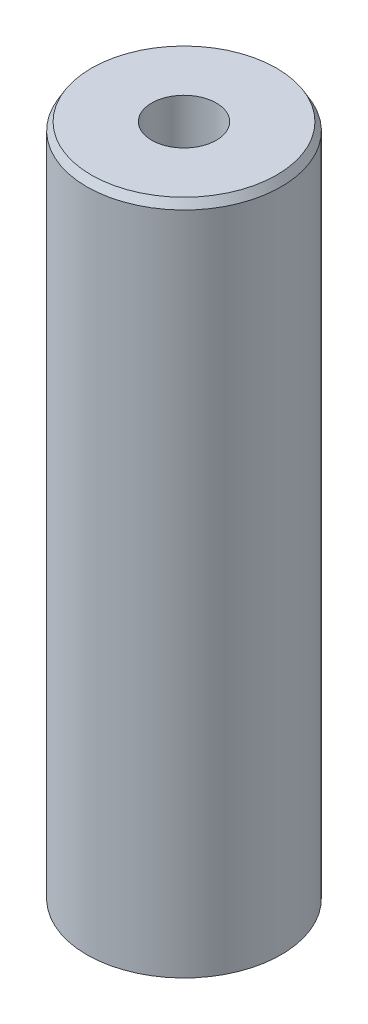
ISO-10303-21;
HEADER;
FILE_DESCRIPTION(('STEP AP214'),'2;1');
FILE_NAME('part.step','',(''),(''),'','','');
FILE_SCHEMA(('AUTOMOTIVE_DESIGN { 1 0 10303 214 1 1 1 1 }'));
ENDSEC;
DATA;
#1=APPLICATION_CONTEXT('core data for automotive mechanical design processes');
#2=APPLICATION_PROTOCOL_DEFINITION('international standard','automotive_design',2000,#1);
#3=PRODUCT_CONTEXT('',#1,'mechanical');
#4=PRODUCT('Part','Part','',(#3));
#5=PRODUCT_RELATED_PRODUCT_CATEGORY('part','',(#4));
#6=PRODUCT_DEFINITION_FORMATION('','',#4);
#7=PRODUCT_DEFINITION_CONTEXT('part definition',#1,'design');
#8=PRODUCT_DEFINITION('design','',#6,#7);
#9=PRODUCT_DEFINITION_SHAPE('','',#8);
#10=(LENGTH_UNIT() NAMED_UNIT(*) SI_UNIT(.MILLI.,.METRE.));
#11=(NAMED_UNIT(*) PLANE_ANGLE_UNIT() SI_UNIT($,.RADIAN.));
#12=(NAMED_UNIT(*) SI_UNIT($,.STERADIAN.) SOLID_ANGLE_UNIT());
#13=UNCERTAINTY_MEASURE_WITH_UNIT(LENGTH_MEASURE(1.E-05),#10,'distance_accuracy_value','');
#14=(GEOMETRIC_REPRESENTATION_CONTEXT(3) GLOBAL_UNCERTAINTY_ASSIGNED_CONTEXT((#13)) GLOBAL_UNIT_ASSIGNED_CONTEXT((#10,
#11,#12)) REPRESENTATION_CONTEXT('',''));
#15=CARTESIAN_POINT('',(0.,0.,0.));
#16=DIRECTION('',(0.,0.,1.));
#17=DIRECTION('',(1.,0.,0.));
#18=AXIS2_PLACEMENT_3D('',#15,#16,#17);
#19=CARTESIAN_POINT('',(0.,313.793971906121,0.));
#20=DIRECTION('',(0.,-1.,0.));
#21=DIRECTION('',(0.,0.,-1.));
#22=AXIS2_PLACEMENT_3D('',#19,#20,#21);
#23=CYLINDRICAL_SURFACE('',#22,45.);
#24=CARTESIAN_POINT('',(0.,310.14276828871,0.));
#25=DIRECTION('',(0.,1.,0.));
#26=DIRECTION('',(0.,0.,1.));
#27=AXIS2_PLACEMENT_3D('',#24,#25,#26);
#28=CIRCLE('',#27,45.);
#29=CARTESIAN_POINT('',(0.,310.14276828871,45.));
#30=VERTEX_POINT('',#29);
#31=EDGE_CURVE('E50',#30,#30,#28,.F.);
#32=ORIENTED_EDGE('',*,*,#31,.T.);
#33=EDGE_LOOP('',(#32));
#34=FACE_BOUND('',#33,.T.);
#35=CARTESIAN_POINT('',(0.,2.10802339137789,0.));
#36=DIRECTION('',(0.,1.,0.));
#37=DIRECTION('',(0.,0.,1.));
#38=AXIS2_PLACEMENT_3D('',#35,#36,#37);
#39=CIRCLE('',#38,45.);
#40=CARTESIAN_POINT('',(0.,2.10802339137789,45.));
#41=VERTEX_POINT('',#40);
#42=EDGE_CURVE('E51',#41,#41,#39,.T.);
#43=ORIENTED_EDGE('',*,*,#42,.T.);
#44=EDGE_LOOP('',(#43));
#45=FACE_BOUND('',#44,.T.);
#46=ADVANCED_FACE('F39',(#34,#45),#23,.T.);
#47=CARTESIAN_POINT('',(0.,313.793971906121,0.));
#48=DIRECTION('',(0.,1.,0.));
#49=DIRECTION('',(0.,0.,1.));
#50=AXIS2_PLACEMENT_3D('',#47,#48,#49);
#51=PLANE('',#50);
#52=CARTESIAN_POINT('',(0.,313.793971906121,0.));
#53=DIRECTION('',(0.,1.,0.));
#54=DIRECTION('',(0.,0.,1.));
#55=AXIS2_PLACEMENT_3D('',#52,#53,#54);
#56=CIRCLE('',#55,42.8919766086221);
#57=CARTESIAN_POINT('',(0.,313.793971906121,42.8919766086221));
#58=VERTEX_POINT('',#57);
#59=EDGE_CURVE('E54',#58,#58,#56,.T.);
#60=ORIENTED_EDGE('',*,*,#59,.T.);
#61=EDGE_LOOP('',(#60));
#62=FACE_BOUND('',#61,.T.);
#63=CARTESIAN_POINT('',(0.,313.793971906121,0.));
#64=DIRECTION('',(0.,1.,0.));
#65=DIRECTION('',(0.,0.,1.));
#66=AXIS2_PLACEMENT_3D('',#63,#64,#65);
#67=CIRCLE('',#66,14.9668758032071);
#68=CARTESIAN_POINT('',(0.,313.793971906121,14.9668758032071));
#69=VERTEX_POINT('',#68);
#70=EDGE_CURVE('E58',#69,#69,#67,.T.);
#71=ORIENTED_EDGE('',*,*,#70,.F.);
#72=EDGE_LOOP('',(#71));
#73=FACE_BOUND('',#72,.T.);
#74=ADVANCED_FACE('F69',(#62,#73),#51,.T.);
#75=CARTESIAN_POINT('',(0.,0.,0.));
#76=DIRECTION('',(0.,1.,0.));
#77=DIRECTION('',(0.,0.,1.));
#78=AXIS2_PLACEMENT_3D('',#75,#76,#77);
#79=PLANE('',#78);
#80=CARTESIAN_POINT('',(0.,0.,0.));
#81=DIRECTION('',(0.,1.,0.));
#82=DIRECTION('',(0.,0.,1.));
#83=AXIS2_PLACEMENT_3D('',#80,#81,#82);
#84=CIRCLE('',#83,41.3487963825898);
#85=CARTESIAN_POINT('',(0.,0.,41.3487963825898));
#86=VERTEX_POINT('',#85);
#87=EDGE_CURVE('E10',#86,#86,#84,.F.);
#88=ORIENTED_EDGE('',*,*,#87,.T.);
#89=EDGE_LOOP('',(#88));
#90=FACE_BOUND('',#89,.T.);
#91=CARTESIAN_POINT('',(0.,0.,0.));
#92=DIRECTION('',(0.,1.,0.));
#93=DIRECTION('',(0.,0.,1.));
#94=AXIS2_PLACEMENT_3D('',#91,#92,#93);
#95=CIRCLE('',#94,14.9668758032071);
#96=CARTESIAN_POINT('',(0.,0.,14.9668758032071));
#97=VERTEX_POINT('',#96);
#98=EDGE_CURVE('E63',#97,#97,#95,.T.);
#99=ORIENTED_EDGE('',*,*,#98,.T.);
#100=EDGE_LOOP('',(#99));
#101=FACE_BOUND('',#100,.T.);
#102=ADVANCED_FACE('F75',(#90,#101),#79,.F.);
#103=CARTESIAN_POINT('',(0.,313.793971906121,0.));
#104=DIRECTION('',(0.,-1.,0.));
#105=DIRECTION('',(0.,0.,-1.));
#106=AXIS2_PLACEMENT_3D('',#103,#104,#105);
#107=CYLINDRICAL_SURFACE('',#106,14.9668758032071);
#108=ORIENTED_EDGE('',*,*,#70,.T.);
#109=EDGE_LOOP('',(#108));
#110=FACE_BOUND('',#109,.T.);
#111=ORIENTED_EDGE('',*,*,#98,.F.);
#112=EDGE_LOOP('',(#111));
#113=FACE_BOUND('',#112,.T.);
#114=ADVANCED_FACE('F70',(#110,#113),#107,.F.);
#115=CARTESIAN_POINT('',(0.,313.793971906121,0.));
#116=DIRECTION('',(0.,-1.,0.));
#117=DIRECTION('',(0.,0.,-1.));
#118=AXIS2_PLACEMENT_3D('',#115,#116,#117);
#119=CONICAL_SURFACE('',#118,42.8919766086221,0.523598775598296);
#120=ORIENTED_EDGE('',*,*,#31,.F.);
#121=EDGE_LOOP('',(#120));
#122=FACE_BOUND('',#121,.T.);
#123=ORIENTED_EDGE('',*,*,#59,.F.);
#124=EDGE_LOOP('',(#123));
#125=FACE_BOUND('',#124,.T.);
#126=ADVANCED_FACE('F81',(#122,#125),#119,.T.);
#127=CARTESIAN_POINT('',(0.,2.10802339137789,0.));
#128=DIRECTION('',(0.,1.,0.));
#129=DIRECTION('',(0.,0.,1.));
#130=AXIS2_PLACEMENT_3D('',#127,#128,#129);
#131=CONICAL_SURFACE('',#130,45.,1.0471975511966);
#132=ORIENTED_EDGE('',*,*,#87,.F.);
#133=EDGE_LOOP('',(#132));
#134=FACE_BOUND('',#133,.T.);
#135=ORIENTED_EDGE('',*,*,#42,.F.);
#136=EDGE_LOOP('',(#135));
#137=FACE_BOUND('',#136,.T.);
#138=ADVANCED_FACE('F45',(#134,#137),#131,.T.);
#139=CLOSED_SHELL('',(#46,#74,#102,#114,#126,#138));
#140=MANIFOLD_SOLID_BREP('B2',#139);
#141=ADVANCED_BREP_SHAPE_REPRESENTATION('',(#18,#140),#14);
#142=SHAPE_DEFINITION_REPRESENTATION(#9,#141);
ENDSEC;
END-ISO-10303-21;
